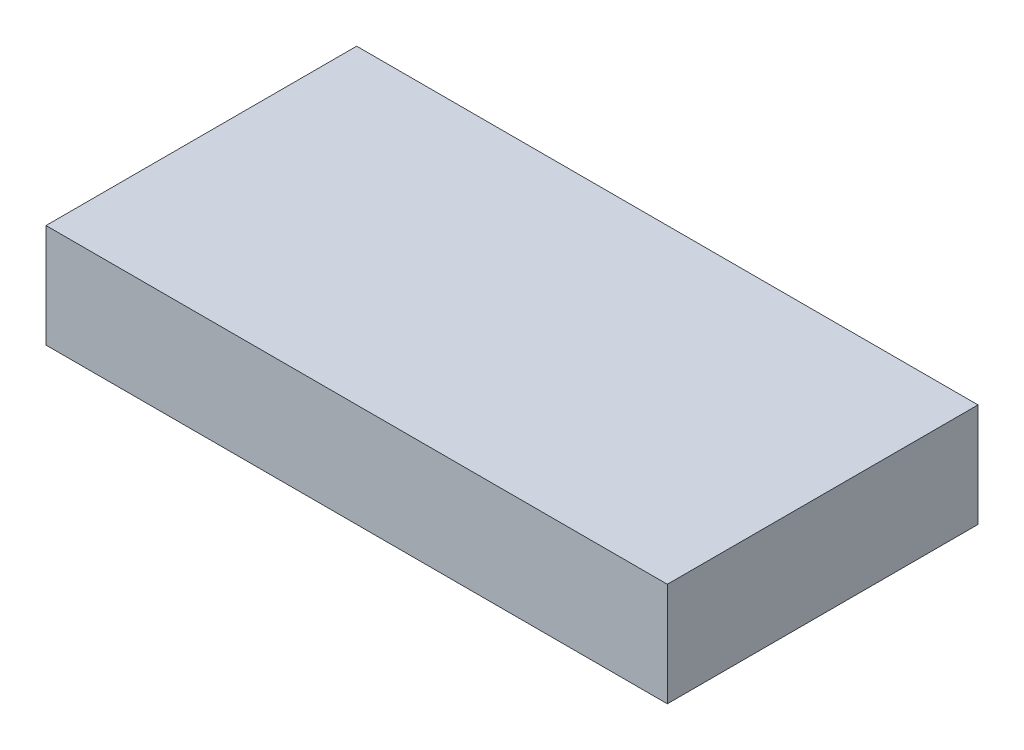
ISO-10303-21;
HEADER;
FILE_DESCRIPTION(('STEP AP214'),'2;1');
FILE_NAME('part.step','',(''),(''),'','','');
FILE_SCHEMA(('AUTOMOTIVE_DESIGN { 1 0 10303 214 1 1 1 1 }'));
ENDSEC;
DATA;
#1=APPLICATION_CONTEXT('core data for automotive mechanical design processes');
#2=APPLICATION_PROTOCOL_DEFINITION('international standard','automotive_design',2000,#1);
#3=PRODUCT_CONTEXT('',#1,'mechanical');
#4=PRODUCT('Part','Part','',(#3));
#5=PRODUCT_RELATED_PRODUCT_CATEGORY('part','',(#4));
#6=PRODUCT_DEFINITION_FORMATION('','',#4);
#7=PRODUCT_DEFINITION_CONTEXT('part definition',#1,'design');
#8=PRODUCT_DEFINITION('design','',#6,#7);
#9=PRODUCT_DEFINITION_SHAPE('','',#8);
#10=(LENGTH_UNIT() NAMED_UNIT(*) SI_UNIT(.MILLI.,.METRE.));
#11=(NAMED_UNIT(*) PLANE_ANGLE_UNIT() SI_UNIT($,.RADIAN.));
#12=(NAMED_UNIT(*) SI_UNIT($,.STERADIAN.) SOLID_ANGLE_UNIT());
#13=UNCERTAINTY_MEASURE_WITH_UNIT(LENGTH_MEASURE(1.E-05),#10,'distance_accuracy_value','');
#14=(GEOMETRIC_REPRESENTATION_CONTEXT(3) GLOBAL_UNCERTAINTY_ASSIGNED_CONTEXT((#13)) GLOBAL_UNIT_ASSIGNED_CONTEXT((#10,
#11,#12)) REPRESENTATION_CONTEXT('',''));
#15=CARTESIAN_POINT('',(0.,0.,0.));
#16=DIRECTION('',(0.,0.,1.));
#17=DIRECTION('',(1.,0.,0.));
#18=AXIS2_PLACEMENT_3D('',#15,#16,#17);
#19=CARTESIAN_POINT('',(0.,10.,0.));
#20=DIRECTION('',(1.,0.,0.));
#21=DIRECTION('',(0.,0.,-1.));
#22=AXIS2_PLACEMENT_3D('',#19,#20,#21);
#23=PLANE('',#22);
#24=DIRECTION('',(0.,0.,1.));
#25=VECTOR('',#24,1.);
#26=CARTESIAN_POINT('',(0.,0.,0.));
#27=LINE('',#26,#25);
#28=CARTESIAN_POINT('',(0.,0.,-30.));
#29=VERTEX_POINT('',#28);
#30=CARTESIAN_POINT('',(0.,0.,0.));
#31=VERTEX_POINT('',#30);
#32=EDGE_CURVE('E99',#29,#31,#27,.T.);
#33=ORIENTED_EDGE('',*,*,#32,.T.);
#34=DIRECTION('',(0.,-1.,0.));
#35=VECTOR('',#34,1.);
#36=CARTESIAN_POINT('',(0.,10.,0.));
#37=LINE('',#36,#35);
#38=CARTESIAN_POINT('',(0.,10.,0.));
#39=VERTEX_POINT('',#38);
#40=EDGE_CURVE('E11',#39,#31,#37,.T.);
#41=ORIENTED_EDGE('',*,*,#40,.F.);
#42=DIRECTION('',(0.,0.,1.));
#43=VECTOR('',#42,1.);
#44=CARTESIAN_POINT('',(0.,10.,0.));
#45=LINE('',#44,#43);
#46=CARTESIAN_POINT('',(0.,10.,-30.));
#47=VERTEX_POINT('',#46);
#48=EDGE_CURVE('E87',#47,#39,#45,.T.);
#49=ORIENTED_EDGE('',*,*,#48,.F.);
#50=DIRECTION('',(0.,-1.,0.));
#51=VECTOR('',#50,1.);
#52=CARTESIAN_POINT('',(0.,10.,-30.));
#53=LINE('',#52,#51);
#54=EDGE_CURVE('E95',#47,#29,#53,.T.);
#55=ORIENTED_EDGE('',*,*,#54,.T.);
#56=EDGE_LOOP('',(#33,#41,#49,#55));
#57=FACE_BOUND('',#56,.T.);
#58=ADVANCED_FACE('F36',(#57),#23,.F.);
#59=CARTESIAN_POINT('',(0.,10.,0.));
#60=DIRECTION('',(0.,0.,-1.));
#61=DIRECTION('',(-1.,0.,0.));
#62=AXIS2_PLACEMENT_3D('',#59,#60,#61);
#63=PLANE('',#62);
#64=DIRECTION('',(1.,0.,0.));
#65=VECTOR('',#64,1.);
#66=CARTESIAN_POINT('',(0.,0.,0.));
#67=LINE('',#66,#65);
#68=CARTESIAN_POINT('',(60.,0.,0.));
#69=VERTEX_POINT('',#68);
#70=EDGE_CURVE('E91',#31,#69,#67,.T.);
#71=ORIENTED_EDGE('',*,*,#70,.T.);
#72=DIRECTION('',(0.,-1.,0.));
#73=VECTOR('',#72,1.);
#74=CARTESIAN_POINT('',(60.,10.,0.));
#75=LINE('',#74,#73);
#76=CARTESIAN_POINT('',(60.,10.,0.));
#77=VERTEX_POINT('',#76);
#78=EDGE_CURVE('E44',#77,#69,#75,.T.);
#79=ORIENTED_EDGE('',*,*,#78,.F.);
#80=DIRECTION('',(1.,0.,0.));
#81=VECTOR('',#80,1.);
#82=CARTESIAN_POINT('',(0.,10.,0.));
#83=LINE('',#82,#81);
#84=EDGE_CURVE('E82',#39,#77,#83,.T.);
#85=ORIENTED_EDGE('',*,*,#84,.F.);
#86=ORIENTED_EDGE('',*,*,#40,.T.);
#87=EDGE_LOOP('',(#71,#79,#85,#86));
#88=FACE_BOUND('',#87,.T.);
#89=ADVANCED_FACE('F90',(#88),#63,.F.);
#90=CARTESIAN_POINT('',(60.,10.,0.));
#91=DIRECTION('',(-1.,0.,0.));
#92=DIRECTION('',(0.,0.,1.));
#93=AXIS2_PLACEMENT_3D('',#90,#91,#92);
#94=PLANE('',#93);
#95=DIRECTION('',(0.,0.,-1.));
#96=VECTOR('',#95,1.);
#97=CARTESIAN_POINT('',(60.,0.,0.));
#98=LINE('',#97,#96);
#99=CARTESIAN_POINT('',(60.,0.,-30.));
#100=VERTEX_POINT('',#99);
#101=EDGE_CURVE('E69',#69,#100,#98,.T.);
#102=ORIENTED_EDGE('',*,*,#101,.T.);
#103=DIRECTION('',(0.,-1.,0.));
#104=VECTOR('',#103,1.);
#105=CARTESIAN_POINT('',(60.,10.,-30.));
#106=LINE('',#105,#104);
#107=CARTESIAN_POINT('',(60.,10.,-30.));
#108=VERTEX_POINT('',#107);
#109=EDGE_CURVE('E92',#108,#100,#106,.T.);
#110=ORIENTED_EDGE('',*,*,#109,.F.);
#111=DIRECTION('',(0.,0.,-1.));
#112=VECTOR('',#111,1.);
#113=CARTESIAN_POINT('',(60.,10.,0.));
#114=LINE('',#113,#112);
#115=EDGE_CURVE('E85',#77,#108,#114,.T.);
#116=ORIENTED_EDGE('',*,*,#115,.F.);
#117=ORIENTED_EDGE('',*,*,#78,.T.);
#118=EDGE_LOOP('',(#102,#110,#116,#117));
#119=FACE_BOUND('',#118,.T.);
#120=ADVANCED_FACE('F93',(#119),#94,.F.);
#121=CARTESIAN_POINT('',(0.,10.,-30.));
#122=DIRECTION('',(0.,0.,1.));
#123=DIRECTION('',(1.,0.,0.));
#124=AXIS2_PLACEMENT_3D('',#121,#122,#123);
#125=PLANE('',#124);
#126=DIRECTION('',(-1.,0.,0.));
#127=VECTOR('',#126,1.);
#128=CARTESIAN_POINT('',(0.,0.,-30.));
#129=LINE('',#128,#127);
#130=EDGE_CURVE('E75',#100,#29,#129,.T.);
#131=ORIENTED_EDGE('',*,*,#130,.T.);
#132=ORIENTED_EDGE('',*,*,#54,.F.);
#133=DIRECTION('',(-1.,0.,0.));
#134=VECTOR('',#133,1.);
#135=CARTESIAN_POINT('',(0.,10.,-30.));
#136=LINE('',#135,#134);
#137=EDGE_CURVE('E52',#108,#47,#136,.T.);
#138=ORIENTED_EDGE('',*,*,#137,.F.);
#139=ORIENTED_EDGE('',*,*,#109,.T.);
#140=EDGE_LOOP('',(#131,#132,#138,#139));
#141=FACE_BOUND('',#140,.T.);
#142=ADVANCED_FACE('F106',(#141),#125,.F.);
#143=CARTESIAN_POINT('',(0.,10.,0.));
#144=DIRECTION('',(0.,-1.,0.));
#145=DIRECTION('',(0.,0.,-1.));
#146=AXIS2_PLACEMENT_3D('',#143,#144,#145);
#147=PLANE('',#146);
#148=ORIENTED_EDGE('',*,*,#48,.T.);
#149=ORIENTED_EDGE('',*,*,#84,.T.);
#150=ORIENTED_EDGE('',*,*,#115,.T.);
#151=ORIENTED_EDGE('',*,*,#137,.T.);
#152=EDGE_LOOP('',(#148,#149,#150,#151));
#153=FACE_BOUND('',#152,.T.);
#154=ADVANCED_FACE('F83',(#153),#147,.F.);
#155=CARTESIAN_POINT('',(0.,0.,0.));
#156=DIRECTION('',(0.,-1.,0.));
#157=DIRECTION('',(0.,0.,-1.));
#158=AXIS2_PLACEMENT_3D('',#155,#156,#157);
#159=PLANE('',#158);
#160=ORIENTED_EDGE('',*,*,#32,.F.);
#161=ORIENTED_EDGE('',*,*,#130,.F.);
#162=ORIENTED_EDGE('',*,*,#101,.F.);
#163=ORIENTED_EDGE('',*,*,#70,.F.);
#164=EDGE_LOOP('',(#160,#161,#162,#163));
#165=FACE_BOUND('',#164,.T.);
#166=ADVANCED_FACE('F109',(#165),#159,.T.);
#167=CLOSED_SHELL('',(#58,#89,#120,#142,#154,#166));
#168=MANIFOLD_SOLID_BREP('B2',#167);
#169=ADVANCED_BREP_SHAPE_REPRESENTATION('',(#18,#168),#14);
#170=SHAPE_DEFINITION_REPRESENTATION(#9,#169);
ENDSEC;
END-ISO-10303-21;
